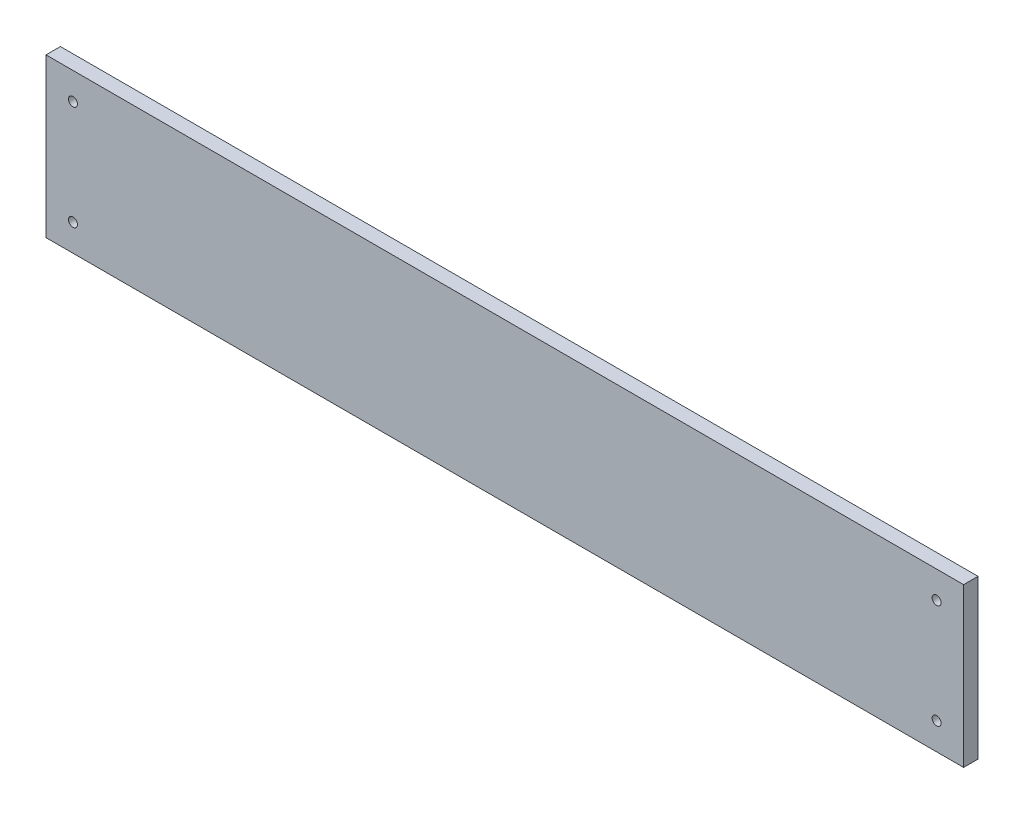
ISO-10303-21;
HEADER;
FILE_DESCRIPTION(('STEP AP214'),'2;1');
FILE_NAME('part.step','',(''),(''),'','','');
FILE_SCHEMA(('AUTOMOTIVE_DESIGN { 1 0 10303 214 1 1 1 1 }'));
ENDSEC;
DATA;
#1=APPLICATION_CONTEXT('core data for automotive mechanical design processes');
#2=APPLICATION_PROTOCOL_DEFINITION('international standard','automotive_design',2000,#1);
#3=PRODUCT_CONTEXT('',#1,'mechanical');
#4=PRODUCT('Part','Part','',(#3));
#5=PRODUCT_RELATED_PRODUCT_CATEGORY('part','',(#4));
#6=PRODUCT_DEFINITION_FORMATION('','',#4);
#7=PRODUCT_DEFINITION_CONTEXT('part definition',#1,'design');
#8=PRODUCT_DEFINITION('design','',#6,#7);
#9=PRODUCT_DEFINITION_SHAPE('','',#8);
#10=(LENGTH_UNIT() NAMED_UNIT(*) SI_UNIT(.MILLI.,.METRE.));
#11=(NAMED_UNIT(*) PLANE_ANGLE_UNIT() SI_UNIT($,.RADIAN.));
#12=(NAMED_UNIT(*) SI_UNIT($,.STERADIAN.) SOLID_ANGLE_UNIT());
#13=UNCERTAINTY_MEASURE_WITH_UNIT(LENGTH_MEASURE(1.E-05),#10,'distance_accuracy_value','');
#14=(GEOMETRIC_REPRESENTATION_CONTEXT(3) GLOBAL_UNCERTAINTY_ASSIGNED_CONTEXT((#13)) GLOBAL_UNIT_ASSIGNED_CONTEXT((#10,
#11,#12)) REPRESENTATION_CONTEXT('',''));
#15=CARTESIAN_POINT('',(0.,0.,0.));
#16=DIRECTION('',(0.,0.,1.));
#17=DIRECTION('',(1.,0.,0.));
#18=AXIS2_PLACEMENT_3D('',#15,#16,#17);
#19=CARTESIAN_POINT('',(161.925,85.09,-243.205));
#20=DIRECTION('',(1.,0.,0.));
#21=DIRECTION('',(0.,0.,-1.));
#22=AXIS2_PLACEMENT_3D('',#19,#20,#21);
#23=PLANE('',#22);
#24=DIRECTION('',(0.,1.,0.));
#25=VECTOR('',#24,1.);
#26=CARTESIAN_POINT('',(161.925,85.09,-238.125));
#27=LINE('',#26,#25);
#28=CARTESIAN_POINT('',(161.925,85.09,-238.125));
#29=VERTEX_POINT('',#28);
#30=CARTESIAN_POINT('',(161.925,140.97,-238.125));
#31=VERTEX_POINT('',#30);
#32=EDGE_CURVE('E98',#29,#31,#27,.T.);
#33=ORIENTED_EDGE('',*,*,#32,.F.);
#34=DIRECTION('',(0.,0.,1.));
#35=VECTOR('',#34,1.);
#36=CARTESIAN_POINT('',(161.925,85.09,-243.205));
#37=LINE('',#36,#35);
#38=CARTESIAN_POINT('',(161.925,85.09,-243.205));
#39=VERTEX_POINT('',#38);
#40=EDGE_CURVE('E11',#39,#29,#37,.T.);
#41=ORIENTED_EDGE('',*,*,#40,.F.);
#42=DIRECTION('',(0.,1.,0.));
#43=VECTOR('',#42,1.);
#44=CARTESIAN_POINT('',(161.925,85.09,-243.205));
#45=LINE('',#44,#43);
#46=CARTESIAN_POINT('',(161.925,140.97,-243.205));
#47=VERTEX_POINT('',#46);
#48=EDGE_CURVE('E91',#39,#47,#45,.T.);
#49=ORIENTED_EDGE('',*,*,#48,.T.);
#50=DIRECTION('',(0.,0.,1.));
#51=VECTOR('',#50,1.);
#52=CARTESIAN_POINT('',(161.925,140.97,-243.205));
#53=LINE('',#52,#51);
#54=EDGE_CURVE('E36',#47,#31,#53,.T.);
#55=ORIENTED_EDGE('',*,*,#54,.T.);
#56=EDGE_LOOP('',(#33,#41,#49,#55));
#57=FACE_BOUND('',#56,.T.);
#58=ADVANCED_FACE('F33',(#57),#23,.T.);
#59=CARTESIAN_POINT('',(-161.925,85.09,-243.205));
#60=DIRECTION('',(0.,-1.,0.));
#61=DIRECTION('',(1.,0.,0.));
#62=AXIS2_PLACEMENT_3D('',#59,#60,#61);
#63=PLANE('',#62);
#64=DIRECTION('',(1.,0.,0.));
#65=VECTOR('',#64,1.);
#66=CARTESIAN_POINT('',(-161.925,85.09,-238.125));
#67=LINE('',#66,#65);
#68=CARTESIAN_POINT('',(-161.925,85.09,-238.125));
#69=VERTEX_POINT('',#68);
#70=EDGE_CURVE('E93',#69,#29,#67,.T.);
#71=ORIENTED_EDGE('',*,*,#70,.F.);
#72=DIRECTION('',(0.,0.,1.));
#73=VECTOR('',#72,1.);
#74=CARTESIAN_POINT('',(-161.925,85.09,-243.205));
#75=LINE('',#74,#73);
#76=CARTESIAN_POINT('',(-161.925,85.09,-243.205));
#77=VERTEX_POINT('',#76);
#78=EDGE_CURVE('E42',#77,#69,#75,.T.);
#79=ORIENTED_EDGE('',*,*,#78,.F.);
#80=DIRECTION('',(1.,0.,0.));
#81=VECTOR('',#80,1.);
#82=CARTESIAN_POINT('',(-161.925,85.09,-243.205));
#83=LINE('',#82,#81);
#84=EDGE_CURVE('E88',#77,#39,#83,.T.);
#85=ORIENTED_EDGE('',*,*,#84,.T.);
#86=ORIENTED_EDGE('',*,*,#40,.T.);
#87=EDGE_LOOP('',(#71,#79,#85,#86));
#88=FACE_BOUND('',#87,.T.);
#89=ADVANCED_FACE('F109',(#88),#63,.T.);
#90=CARTESIAN_POINT('',(-161.925,85.09,-243.205));
#91=DIRECTION('',(-1.,0.,0.));
#92=DIRECTION('',(0.,0.,1.));
#93=AXIS2_PLACEMENT_3D('',#90,#91,#92);
#94=PLANE('',#93);
#95=DIRECTION('',(0.,-1.,0.));
#96=VECTOR('',#95,1.);
#97=CARTESIAN_POINT('',(-161.925,85.09,-238.125));
#98=LINE('',#97,#96);
#99=CARTESIAN_POINT('',(-161.925,140.97,-238.125));
#100=VERTEX_POINT('',#99);
#101=EDGE_CURVE('E83',#100,#69,#98,.T.);
#102=ORIENTED_EDGE('',*,*,#101,.F.);
#103=DIRECTION('',(0.,0.,1.));
#104=VECTOR('',#103,1.);
#105=CARTESIAN_POINT('',(-161.925,140.97,-243.205));
#106=LINE('',#105,#104);
#107=CARTESIAN_POINT('',(-161.925,140.97,-243.205));
#108=VERTEX_POINT('',#107);
#109=EDGE_CURVE('E78',#108,#100,#106,.T.);
#110=ORIENTED_EDGE('',*,*,#109,.F.);
#111=DIRECTION('',(0.,-1.,0.));
#112=VECTOR('',#111,1.);
#113=CARTESIAN_POINT('',(-161.925,85.09,-243.205));
#114=LINE('',#113,#112);
#115=EDGE_CURVE('E81',#108,#77,#114,.T.);
#116=ORIENTED_EDGE('',*,*,#115,.T.);
#117=ORIENTED_EDGE('',*,*,#78,.T.);
#118=EDGE_LOOP('',(#102,#110,#116,#117));
#119=FACE_BOUND('',#118,.T.);
#120=ADVANCED_FACE('F80',(#119),#94,.T.);
#121=CARTESIAN_POINT('',(-161.925,140.97,-243.205));
#122=DIRECTION('',(0.,1.,0.));
#123=DIRECTION('',(0.,0.,1.));
#124=AXIS2_PLACEMENT_3D('',#121,#122,#123);
#125=PLANE('',#124);
#126=DIRECTION('',(-1.,0.,0.));
#127=VECTOR('',#126,1.);
#128=CARTESIAN_POINT('',(-161.925,140.97,-238.125));
#129=LINE('',#128,#127);
#130=EDGE_CURVE('E101',#31,#100,#129,.T.);
#131=ORIENTED_EDGE('',*,*,#130,.F.);
#132=ORIENTED_EDGE('',*,*,#54,.F.);
#133=DIRECTION('',(-1.,0.,0.));
#134=VECTOR('',#133,1.);
#135=CARTESIAN_POINT('',(-161.925,140.97,-243.205));
#136=LINE('',#135,#134);
#137=EDGE_CURVE('E87',#47,#108,#136,.T.);
#138=ORIENTED_EDGE('',*,*,#137,.T.);
#139=ORIENTED_EDGE('',*,*,#109,.T.);
#140=EDGE_LOOP('',(#131,#132,#138,#139));
#141=FACE_BOUND('',#140,.T.);
#142=ADVANCED_FACE('F90',(#141),#125,.T.);
#143=CARTESIAN_POINT('',(0.,0.,-243.205));
#144=DIRECTION('',(0.,0.,-1.));
#145=DIRECTION('',(-1.,0.,0.));
#146=AXIS2_PLACEMENT_3D('',#143,#144,#145);
#147=PLANE('',#146);
#148=CARTESIAN_POINT('',(-152.399999999999,94.6150000000001,-243.205));
#149=DIRECTION('',(0.,0.,1.));
#150=DIRECTION('',(1.,0.,0.));
#151=AXIS2_PLACEMENT_3D('',#148,#149,#150);
#152=CIRCLE('',#151,1.58749999999999);
#153=CARTESIAN_POINT('',(-150.812499999999,94.6150000000001,-243.205));
#154=VERTEX_POINT('',#153);
#155=EDGE_CURVE('E150',#154,#154,#152,.T.);
#156=ORIENTED_EDGE('',*,*,#155,.T.);
#157=EDGE_LOOP('',(#156));
#158=FACE_BOUND('',#157,.T.);
#159=CARTESIAN_POINT('',(152.4,94.6150000000001,-243.205));
#160=DIRECTION('',(0.,0.,1.));
#161=DIRECTION('',(1.,0.,0.));
#162=AXIS2_PLACEMENT_3D('',#159,#160,#161);
#163=CIRCLE('',#162,1.58749999999999);
#164=CARTESIAN_POINT('',(153.9875,94.6150000000001,-243.205));
#165=VERTEX_POINT('',#164);
#166=EDGE_CURVE('E158',#165,#165,#163,.T.);
#167=ORIENTED_EDGE('',*,*,#166,.T.);
#168=EDGE_LOOP('',(#167));
#169=FACE_BOUND('',#168,.T.);
#170=CARTESIAN_POINT('',(152.4,131.445,-243.205));
#171=DIRECTION('',(0.,0.,1.));
#172=DIRECTION('',(1.,0.,0.));
#173=AXIS2_PLACEMENT_3D('',#170,#171,#172);
#174=CIRCLE('',#173,1.58749999999999);
#175=CARTESIAN_POINT('',(153.9875,131.445,-243.205));
#176=VERTEX_POINT('',#175);
#177=EDGE_CURVE('E164',#176,#176,#174,.T.);
#178=ORIENTED_EDGE('',*,*,#177,.T.);
#179=EDGE_LOOP('',(#178));
#180=FACE_BOUND('',#179,.T.);
#181=CARTESIAN_POINT('',(-152.4,131.445,-243.205));
#182=DIRECTION('',(0.,0.,1.));
#183=DIRECTION('',(1.,0.,0.));
#184=AXIS2_PLACEMENT_3D('',#181,#182,#183);
#185=CIRCLE('',#184,1.58749999999999);
#186=CARTESIAN_POINT('',(-150.8125,131.445,-243.205));
#187=VERTEX_POINT('',#186);
#188=EDGE_CURVE('E102',#187,#187,#185,.T.);
#189=ORIENTED_EDGE('',*,*,#188,.T.);
#190=EDGE_LOOP('',(#189));
#191=FACE_BOUND('',#190,.T.);
#192=ORIENTED_EDGE('',*,*,#48,.F.);
#193=ORIENTED_EDGE('',*,*,#84,.F.);
#194=ORIENTED_EDGE('',*,*,#115,.F.);
#195=ORIENTED_EDGE('',*,*,#137,.F.);
#196=EDGE_LOOP('',(#192,#193,#194,#195));
#197=FACE_BOUND('',#196,.T.);
#198=ADVANCED_FACE('F86',(#158,#169,#180,#191,#197),#147,.T.);
#199=CARTESIAN_POINT('',(0.,0.,-238.125));
#200=DIRECTION('',(0.,0.,-1.));
#201=DIRECTION('',(-1.,0.,0.));
#202=AXIS2_PLACEMENT_3D('',#199,#200,#201);
#203=PLANE('',#202);
#204=CARTESIAN_POINT('',(-152.399999999999,94.6150000000001,-238.125));
#205=DIRECTION('',(0.,0.,1.));
#206=DIRECTION('',(1.,0.,0.));
#207=AXIS2_PLACEMENT_3D('',#204,#205,#206);
#208=CIRCLE('',#207,1.58749999999999);
#209=CARTESIAN_POINT('',(-150.812499999999,94.6150000000001,-238.125));
#210=VERTEX_POINT('',#209);
#211=EDGE_CURVE('E153',#210,#210,#208,.T.);
#212=ORIENTED_EDGE('',*,*,#211,.F.);
#213=EDGE_LOOP('',(#212));
#214=FACE_BOUND('',#213,.T.);
#215=CARTESIAN_POINT('',(152.4,94.6150000000001,-238.125));
#216=DIRECTION('',(0.,0.,1.));
#217=DIRECTION('',(1.,0.,0.));
#218=AXIS2_PLACEMENT_3D('',#215,#216,#217);
#219=CIRCLE('',#218,1.58749999999999);
#220=CARTESIAN_POINT('',(153.9875,94.6150000000001,-238.125));
#221=VERTEX_POINT('',#220);
#222=EDGE_CURVE('E155',#221,#221,#219,.T.);
#223=ORIENTED_EDGE('',*,*,#222,.F.);
#224=EDGE_LOOP('',(#223));
#225=FACE_BOUND('',#224,.T.);
#226=CARTESIAN_POINT('',(152.4,131.445,-238.125));
#227=DIRECTION('',(0.,0.,1.));
#228=DIRECTION('',(1.,0.,0.));
#229=AXIS2_PLACEMENT_3D('',#226,#227,#228);
#230=CIRCLE('',#229,1.58749999999999);
#231=CARTESIAN_POINT('',(153.9875,131.445,-238.125));
#232=VERTEX_POINT('',#231);
#233=EDGE_CURVE('E161',#232,#232,#230,.T.);
#234=ORIENTED_EDGE('',*,*,#233,.F.);
#235=EDGE_LOOP('',(#234));
#236=FACE_BOUND('',#235,.T.);
#237=CARTESIAN_POINT('',(-152.4,131.445,-238.125));
#238=DIRECTION('',(0.,0.,1.));
#239=DIRECTION('',(1.,0.,0.));
#240=AXIS2_PLACEMENT_3D('',#237,#238,#239);
#241=CIRCLE('',#240,1.58749999999999);
#242=CARTESIAN_POINT('',(-150.8125,131.445,-238.125));
#243=VERTEX_POINT('',#242);
#244=EDGE_CURVE('E167',#243,#243,#241,.T.);
#245=ORIENTED_EDGE('',*,*,#244,.F.);
#246=EDGE_LOOP('',(#245));
#247=FACE_BOUND('',#246,.T.);
#248=ORIENTED_EDGE('',*,*,#32,.T.);
#249=ORIENTED_EDGE('',*,*,#130,.T.);
#250=ORIENTED_EDGE('',*,*,#101,.T.);
#251=ORIENTED_EDGE('',*,*,#70,.T.);
#252=EDGE_LOOP('',(#248,#249,#250,#251));
#253=FACE_BOUND('',#252,.T.);
#254=ADVANCED_FACE('F108',(#214,#225,#236,#247,#253),#203,.F.);
#255=CARTESIAN_POINT('',(-152.4,131.445,-243.205));
#256=DIRECTION('',(0.,0.,1.));
#257=DIRECTION('',(1.,0.,0.));
#258=AXIS2_PLACEMENT_3D('',#255,#256,#257);
#259=CYLINDRICAL_SURFACE('',#258,1.58749999999999);
#260=ORIENTED_EDGE('',*,*,#188,.F.);
#261=EDGE_LOOP('',(#260));
#262=FACE_BOUND('',#261,.T.);
#263=ORIENTED_EDGE('',*,*,#244,.T.);
#264=EDGE_LOOP('',(#263));
#265=FACE_BOUND('',#264,.T.);
#266=ADVANCED_FACE('F127',(#262,#265),#259,.F.);
#267=CARTESIAN_POINT('',(152.4,131.445,-243.205));
#268=DIRECTION('',(0.,0.,1.));
#269=DIRECTION('',(1.,0.,0.));
#270=AXIS2_PLACEMENT_3D('',#267,#268,#269);
#271=CYLINDRICAL_SURFACE('',#270,1.58749999999999);
#272=ORIENTED_EDGE('',*,*,#177,.F.);
#273=EDGE_LOOP('',(#272));
#274=FACE_BOUND('',#273,.T.);
#275=ORIENTED_EDGE('',*,*,#233,.T.);
#276=EDGE_LOOP('',(#275));
#277=FACE_BOUND('',#276,.T.);
#278=ADVANCED_FACE('F134',(#274,#277),#271,.F.);
#279=CARTESIAN_POINT('',(152.4,94.6150000000001,-243.205));
#280=DIRECTION('',(0.,0.,1.));
#281=DIRECTION('',(1.,0.,0.));
#282=AXIS2_PLACEMENT_3D('',#279,#280,#281);
#283=CYLINDRICAL_SURFACE('',#282,1.58749999999999);
#284=ORIENTED_EDGE('',*,*,#166,.F.);
#285=EDGE_LOOP('',(#284));
#286=FACE_BOUND('',#285,.T.);
#287=ORIENTED_EDGE('',*,*,#222,.T.);
#288=EDGE_LOOP('',(#287));
#289=FACE_BOUND('',#288,.T.);
#290=ADVANCED_FACE('F138',(#286,#289),#283,.F.);
#291=CARTESIAN_POINT('',(-152.399999999999,94.6150000000001,-243.205));
#292=DIRECTION('',(0.,0.,1.));
#293=DIRECTION('',(1.,0.,0.));
#294=AXIS2_PLACEMENT_3D('',#291,#292,#293);
#295=CYLINDRICAL_SURFACE('',#294,1.58749999999999);
#296=ORIENTED_EDGE('',*,*,#155,.F.);
#297=EDGE_LOOP('',(#296));
#298=FACE_BOUND('',#297,.T.);
#299=ORIENTED_EDGE('',*,*,#211,.T.);
#300=EDGE_LOOP('',(#299));
#301=FACE_BOUND('',#300,.T.);
#302=ADVANCED_FACE('F142',(#298,#301),#295,.F.);
#303=CLOSED_SHELL('',(#58,#89,#120,#142,#198,#254,#266,#278,#290,#302));
#304=MANIFOLD_SOLID_BREP('B2',#303);
#305=ADVANCED_BREP_SHAPE_REPRESENTATION('',(#18,#304),#14);
#306=SHAPE_DEFINITION_REPRESENTATION(#9,#305);
ENDSEC;
END-ISO-10303-21;
